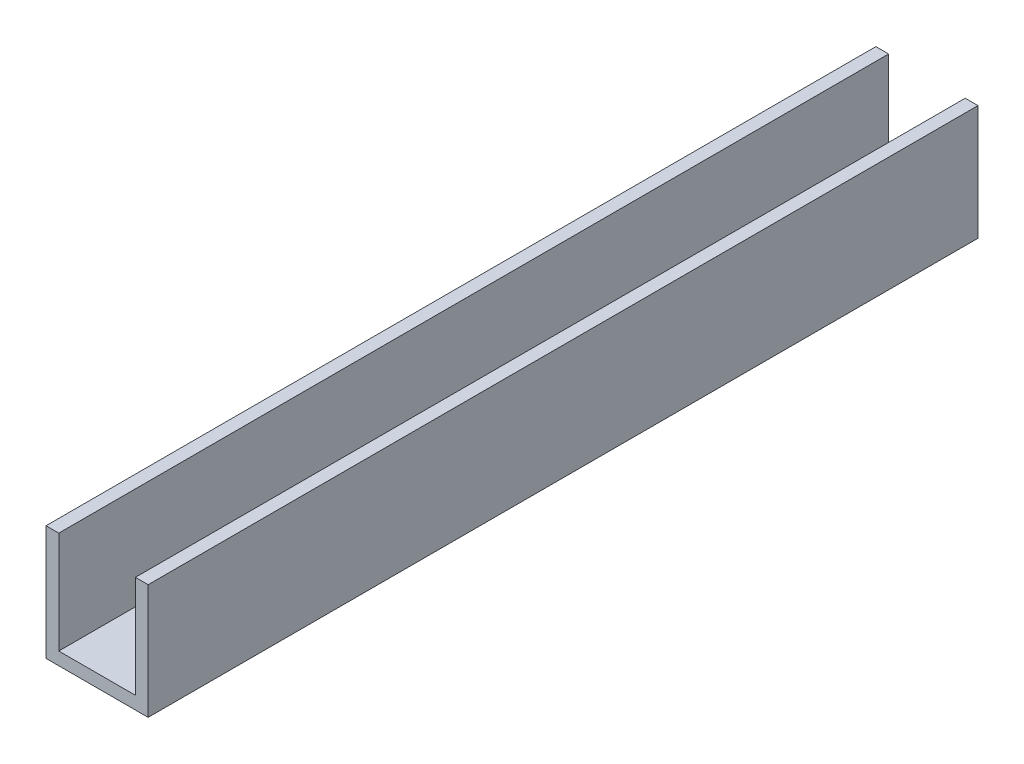
ISO-10303-21;
HEADER;
FILE_DESCRIPTION(('STEP AP214'),'2;1');
FILE_NAME('part.step','',(''),(''),'','','');
FILE_SCHEMA(('AUTOMOTIVE_DESIGN { 1 0 10303 214 1 1 1 1 }'));
ENDSEC;
DATA;
#1=APPLICATION_CONTEXT('core data for automotive mechanical design processes');
#2=APPLICATION_PROTOCOL_DEFINITION('international standard','automotive_design',2000,#1);
#3=PRODUCT_CONTEXT('',#1,'mechanical');
#4=PRODUCT('Part','Part','',(#3));
#5=PRODUCT_RELATED_PRODUCT_CATEGORY('part','',(#4));
#6=PRODUCT_DEFINITION_FORMATION('','',#4);
#7=PRODUCT_DEFINITION_CONTEXT('part definition',#1,'design');
#8=PRODUCT_DEFINITION('design','',#6,#7);
#9=PRODUCT_DEFINITION_SHAPE('','',#8);
#10=(LENGTH_UNIT() NAMED_UNIT(*) SI_UNIT(.MILLI.,.METRE.));
#11=(NAMED_UNIT(*) PLANE_ANGLE_UNIT() SI_UNIT($,.RADIAN.));
#12=(NAMED_UNIT(*) SI_UNIT($,.STERADIAN.) SOLID_ANGLE_UNIT());
#13=UNCERTAINTY_MEASURE_WITH_UNIT(LENGTH_MEASURE(1.E-05),#10,'distance_accuracy_value','');
#14=(GEOMETRIC_REPRESENTATION_CONTEXT(3) GLOBAL_UNCERTAINTY_ASSIGNED_CONTEXT((#13)) GLOBAL_UNIT_ASSIGNED_CONTEXT((#10,
#11,#12)) REPRESENTATION_CONTEXT('',''));
#15=CARTESIAN_POINT('',(0.,0.,0.));
#16=DIRECTION('',(0.,0.,1.));
#17=DIRECTION('',(1.,0.,0.));
#18=AXIS2_PLACEMENT_3D('',#15,#16,#17);
#19=CARTESIAN_POINT('',(0.,0.,6500.));
#20=DIRECTION('',(-1.,0.,0.));
#21=DIRECTION('',(0.,0.,1.));
#22=AXIS2_PLACEMENT_3D('',#19,#20,#21);
#23=PLANE('',#22);
#24=DIRECTION('',(0.,1.,0.));
#25=VECTOR('',#24,1.);
#26=CARTESIAN_POINT('',(0.,0.,0.));
#27=LINE('',#26,#25);
#28=CARTESIAN_POINT('',(0.,0.,0.));
#29=VERTEX_POINT('',#28);
#30=CARTESIAN_POINT('',(0.,900.,0.));
#31=VERTEX_POINT('',#30);
#32=EDGE_CURVE('E128',#29,#31,#27,.T.);
#33=ORIENTED_EDGE('',*,*,#32,.T.);
#34=DIRECTION('',(0.,0.,-1.));
#35=VECTOR('',#34,1.);
#36=CARTESIAN_POINT('',(0.,900.,6500.));
#37=LINE('',#36,#35);
#38=CARTESIAN_POINT('',(0.,900.,6500.));
#39=VERTEX_POINT('',#38);
#40=EDGE_CURVE('E11',#39,#31,#37,.T.);
#41=ORIENTED_EDGE('',*,*,#40,.F.);
#42=DIRECTION('',(0.,1.,0.));
#43=VECTOR('',#42,1.);
#44=CARTESIAN_POINT('',(0.,0.,6500.));
#45=LINE('',#44,#43);
#46=CARTESIAN_POINT('',(0.,0.,6500.));
#47=VERTEX_POINT('',#46);
#48=EDGE_CURVE('E142',#47,#39,#45,.T.);
#49=ORIENTED_EDGE('',*,*,#48,.F.);
#50=DIRECTION('',(0.,0.,-1.));
#51=VECTOR('',#50,1.);
#52=CARTESIAN_POINT('',(0.,0.,6500.));
#53=LINE('',#52,#51);
#54=EDGE_CURVE('E124',#47,#29,#53,.T.);
#55=ORIENTED_EDGE('',*,*,#54,.T.);
#56=EDGE_LOOP('',(#33,#41,#49,#55));
#57=FACE_BOUND('',#56,.T.);
#58=ADVANCED_FACE('F32',(#57),#23,.F.);
#59=CARTESIAN_POINT('',(-100.,900.,6500.));
#60=DIRECTION('',(0.,-1.,0.));
#61=DIRECTION('',(1.,0.,0.));
#62=AXIS2_PLACEMENT_3D('',#59,#60,#61);
#63=PLANE('',#62);
#64=DIRECTION('',(-1.,0.,0.));
#65=VECTOR('',#64,1.);
#66=CARTESIAN_POINT('',(-100.,900.,0.));
#67=LINE('',#66,#65);
#68=CARTESIAN_POINT('',(-100.,900.,0.));
#69=VERTEX_POINT('',#68);
#70=EDGE_CURVE('E131',#31,#69,#67,.T.);
#71=ORIENTED_EDGE('',*,*,#70,.T.);
#72=DIRECTION('',(0.,0.,-1.));
#73=VECTOR('',#72,1.);
#74=CARTESIAN_POINT('',(-100.,900.,6500.));
#75=LINE('',#74,#73);
#76=CARTESIAN_POINT('',(-100.,900.,6500.));
#77=VERTEX_POINT('',#76);
#78=EDGE_CURVE('E40',#77,#69,#75,.T.);
#79=ORIENTED_EDGE('',*,*,#78,.F.);
#80=DIRECTION('',(-1.,0.,0.));
#81=VECTOR('',#80,1.);
#82=CARTESIAN_POINT('',(-100.,900.,6500.));
#83=LINE('',#82,#81);
#84=EDGE_CURVE('E91',#39,#77,#83,.T.);
#85=ORIENTED_EDGE('',*,*,#84,.F.);
#86=ORIENTED_EDGE('',*,*,#40,.T.);
#87=EDGE_LOOP('',(#71,#79,#85,#86));
#88=FACE_BOUND('',#87,.T.);
#89=ADVANCED_FACE('F177',(#88),#63,.F.);
#90=CARTESIAN_POINT('',(-100.,99.9999999999999,6500.));
#91=DIRECTION('',(1.,0.,0.));
#92=DIRECTION('',(0.,1.,0.));
#93=AXIS2_PLACEMENT_3D('',#90,#91,#92);
#94=PLANE('',#93);
#95=DIRECTION('',(0.,-1.,0.));
#96=VECTOR('',#95,1.);
#97=CARTESIAN_POINT('',(-100.,99.9999999999999,0.));
#98=LINE('',#97,#96);
#99=CARTESIAN_POINT('',(-100.,99.9999999999999,0.));
#100=VERTEX_POINT('',#99);
#101=EDGE_CURVE('E133',#69,#100,#98,.T.);
#102=ORIENTED_EDGE('',*,*,#101,.T.);
#103=DIRECTION('',(0.,0.,-1.));
#104=VECTOR('',#103,1.);
#105=CARTESIAN_POINT('',(-100.,99.9999999999999,6500.));
#106=LINE('',#105,#104);
#107=CARTESIAN_POINT('',(-100.,99.9999999999999,6500.));
#108=VERTEX_POINT('',#107);
#109=EDGE_CURVE('E149',#108,#100,#106,.T.);
#110=ORIENTED_EDGE('',*,*,#109,.F.);
#111=DIRECTION('',(0.,-1.,0.));
#112=VECTOR('',#111,1.);
#113=CARTESIAN_POINT('',(-100.,99.9999999999999,6500.));
#114=LINE('',#113,#112);
#115=EDGE_CURVE('E157',#77,#108,#114,.T.);
#116=ORIENTED_EDGE('',*,*,#115,.F.);
#117=ORIENTED_EDGE('',*,*,#78,.T.);
#118=EDGE_LOOP('',(#102,#110,#116,#117));
#119=FACE_BOUND('',#118,.T.);
#120=ADVANCED_FACE('F155',(#119),#94,.F.);
#121=CARTESIAN_POINT('',(-700.,99.9999999999999,6500.));
#122=DIRECTION('',(0.,-1.,0.));
#123=DIRECTION('',(0.,0.,-1.));
#124=AXIS2_PLACEMENT_3D('',#121,#122,#123);
#125=PLANE('',#124);
#126=DIRECTION('',(-1.,0.,0.));
#127=VECTOR('',#126,1.);
#128=CARTESIAN_POINT('',(-700.,99.9999999999999,0.));
#129=LINE('',#128,#127);
#130=CARTESIAN_POINT('',(-700.,99.9999999999999,0.));
#131=VERTEX_POINT('',#130);
#132=EDGE_CURVE('E135',#100,#131,#129,.T.);
#133=ORIENTED_EDGE('',*,*,#132,.T.);
#134=DIRECTION('',(0.,0.,-1.));
#135=VECTOR('',#134,1.);
#136=CARTESIAN_POINT('',(-700.,99.9999999999999,6500.));
#137=LINE('',#136,#135);
#138=CARTESIAN_POINT('',(-700.,99.9999999999999,6500.));
#139=VERTEX_POINT('',#138);
#140=EDGE_CURVE('E146',#139,#131,#137,.T.);
#141=ORIENTED_EDGE('',*,*,#140,.F.);
#142=DIRECTION('',(-1.,0.,0.));
#143=VECTOR('',#142,1.);
#144=CARTESIAN_POINT('',(-700.,99.9999999999999,6500.));
#145=LINE('',#144,#143);
#146=EDGE_CURVE('E169',#108,#139,#145,.T.);
#147=ORIENTED_EDGE('',*,*,#146,.F.);
#148=ORIENTED_EDGE('',*,*,#109,.T.);
#149=EDGE_LOOP('',(#133,#141,#147,#148));
#150=FACE_BOUND('',#149,.T.);
#151=ADVANCED_FACE('F165',(#150),#125,.F.);
#152=CARTESIAN_POINT('',(-700.,99.9999999999999,6500.));
#153=DIRECTION('',(-1.,0.,0.));
#154=DIRECTION('',(0.,0.,1.));
#155=AXIS2_PLACEMENT_3D('',#152,#153,#154);
#156=PLANE('',#155);
#157=DIRECTION('',(0.,1.,0.));
#158=VECTOR('',#157,1.);
#159=CARTESIAN_POINT('',(-700.,99.9999999999999,0.));
#160=LINE('',#159,#158);
#161=CARTESIAN_POINT('',(-700.,900.,0.));
#162=VERTEX_POINT('',#161);
#163=EDGE_CURVE('E137',#131,#162,#160,.T.);
#164=ORIENTED_EDGE('',*,*,#163,.T.);
#165=DIRECTION('',(0.,0.,-1.));
#166=VECTOR('',#165,1.);
#167=CARTESIAN_POINT('',(-700.,900.,6500.));
#168=LINE('',#167,#166);
#169=CARTESIAN_POINT('',(-700.,900.,6500.));
#170=VERTEX_POINT('',#169);
#171=EDGE_CURVE('E119',#170,#162,#168,.T.);
#172=ORIENTED_EDGE('',*,*,#171,.F.);
#173=DIRECTION('',(0.,1.,0.));
#174=VECTOR('',#173,1.);
#175=CARTESIAN_POINT('',(-700.,99.9999999999999,6500.));
#176=LINE('',#175,#174);
#177=EDGE_CURVE('E110',#139,#170,#176,.T.);
#178=ORIENTED_EDGE('',*,*,#177,.F.);
#179=ORIENTED_EDGE('',*,*,#140,.T.);
#180=EDGE_LOOP('',(#164,#172,#178,#179));
#181=FACE_BOUND('',#180,.T.);
#182=ADVANCED_FACE('F168',(#181),#156,.F.);
#183=CARTESIAN_POINT('',(-700.,900.,6500.));
#184=DIRECTION('',(0.,-1.,0.));
#185=DIRECTION('',(0.,0.,-1.));
#186=AXIS2_PLACEMENT_3D('',#183,#184,#185);
#187=PLANE('',#186);
#188=DIRECTION('',(-1.,0.,0.));
#189=VECTOR('',#188,1.);
#190=CARTESIAN_POINT('',(-700.,900.,0.));
#191=LINE('',#190,#189);
#192=CARTESIAN_POINT('',(-800.,900.,0.));
#193=VERTEX_POINT('',#192);
#194=EDGE_CURVE('E118',#162,#193,#191,.T.);
#195=ORIENTED_EDGE('',*,*,#194,.T.);
#196=DIRECTION('',(0.,0.,-1.));
#197=VECTOR('',#196,1.);
#198=CARTESIAN_POINT('',(-800.,900.,6500.));
#199=LINE('',#198,#197);
#200=CARTESIAN_POINT('',(-800.,900.,6500.));
#201=VERTEX_POINT('',#200);
#202=EDGE_CURVE('E115',#201,#193,#199,.T.);
#203=ORIENTED_EDGE('',*,*,#202,.F.);
#204=DIRECTION('',(-1.,0.,0.));
#205=VECTOR('',#204,1.);
#206=CARTESIAN_POINT('',(-700.,900.,6500.));
#207=LINE('',#206,#205);
#208=EDGE_CURVE('E104',#170,#201,#207,.T.);
#209=ORIENTED_EDGE('',*,*,#208,.F.);
#210=ORIENTED_EDGE('',*,*,#171,.T.);
#211=EDGE_LOOP('',(#195,#203,#209,#210));
#212=FACE_BOUND('',#211,.T.);
#213=ADVANCED_FACE('F116',(#212),#187,.F.);
#214=CARTESIAN_POINT('',(-800.,0.,6500.));
#215=DIRECTION('',(1.,0.,0.));
#216=DIRECTION('',(0.,0.,-1.));
#217=AXIS2_PLACEMENT_3D('',#214,#215,#216);
#218=PLANE('',#217);
#219=DIRECTION('',(0.,-1.,0.));
#220=VECTOR('',#219,1.);
#221=CARTESIAN_POINT('',(-800.,0.,0.));
#222=LINE('',#221,#220);
#223=CARTESIAN_POINT('',(-800.,0.,0.));
#224=VERTEX_POINT('',#223);
#225=EDGE_CURVE('E77',#193,#224,#222,.T.);
#226=ORIENTED_EDGE('',*,*,#225,.T.);
#227=DIRECTION('',(0.,0.,-1.));
#228=VECTOR('',#227,1.);
#229=CARTESIAN_POINT('',(-800.,0.,6500.));
#230=LINE('',#229,#228);
#231=CARTESIAN_POINT('',(-800.,0.,6500.));
#232=VERTEX_POINT('',#231);
#233=EDGE_CURVE('E120',#232,#224,#230,.T.);
#234=ORIENTED_EDGE('',*,*,#233,.F.);
#235=DIRECTION('',(0.,-1.,0.));
#236=VECTOR('',#235,1.);
#237=CARTESIAN_POINT('',(-800.,0.,6500.));
#238=LINE('',#237,#236);
#239=EDGE_CURVE('E108',#201,#232,#238,.T.);
#240=ORIENTED_EDGE('',*,*,#239,.F.);
#241=ORIENTED_EDGE('',*,*,#202,.T.);
#242=EDGE_LOOP('',(#226,#234,#240,#241));
#243=FACE_BOUND('',#242,.T.);
#244=ADVANCED_FACE('F122',(#243),#218,.F.);
#245=CARTESIAN_POINT('',(0.,0.,6500.));
#246=DIRECTION('',(0.,1.,0.));
#247=DIRECTION('',(0.,0.,1.));
#248=AXIS2_PLACEMENT_3D('',#245,#246,#247);
#249=PLANE('',#248);
#250=DIRECTION('',(1.,0.,0.));
#251=VECTOR('',#250,1.);
#252=CARTESIAN_POINT('',(0.,0.,0.));
#253=LINE('',#252,#251);
#254=EDGE_CURVE('E83',#224,#29,#253,.T.);
#255=ORIENTED_EDGE('',*,*,#254,.T.);
#256=ORIENTED_EDGE('',*,*,#54,.F.);
#257=DIRECTION('',(1.,0.,0.));
#258=VECTOR('',#257,1.);
#259=CARTESIAN_POINT('',(0.,0.,6500.));
#260=LINE('',#259,#258);
#261=EDGE_CURVE('E48',#232,#47,#260,.T.);
#262=ORIENTED_EDGE('',*,*,#261,.F.);
#263=ORIENTED_EDGE('',*,*,#233,.T.);
#264=EDGE_LOOP('',(#255,#256,#262,#263));
#265=FACE_BOUND('',#264,.T.);
#266=ADVANCED_FACE('F193',(#265),#249,.F.);
#267=CARTESIAN_POINT('',(0.,0.,6500.));
#268=DIRECTION('',(0.,0.,-1.));
#269=DIRECTION('',(-1.,0.,0.));
#270=AXIS2_PLACEMENT_3D('',#267,#268,#269);
#271=PLANE('',#270);
#272=ORIENTED_EDGE('',*,*,#48,.T.);
#273=ORIENTED_EDGE('',*,*,#84,.T.);
#274=ORIENTED_EDGE('',*,*,#115,.T.);
#275=ORIENTED_EDGE('',*,*,#146,.T.);
#276=ORIENTED_EDGE('',*,*,#177,.T.);
#277=ORIENTED_EDGE('',*,*,#208,.T.);
#278=ORIENTED_EDGE('',*,*,#239,.T.);
#279=ORIENTED_EDGE('',*,*,#261,.T.);
#280=EDGE_LOOP('',(#272,#273,#274,#275,#276,#277,#278,#279));
#281=FACE_BOUND('',#280,.T.);
#282=ADVANCED_FACE('F106',(#281),#271,.F.);
#283=CARTESIAN_POINT('',(0.,0.,0.));
#284=DIRECTION('',(0.,0.,-1.));
#285=DIRECTION('',(-1.,0.,0.));
#286=AXIS2_PLACEMENT_3D('',#283,#284,#285);
#287=PLANE('',#286);
#288=ORIENTED_EDGE('',*,*,#32,.F.);
#289=ORIENTED_EDGE('',*,*,#254,.F.);
#290=ORIENTED_EDGE('',*,*,#225,.F.);
#291=ORIENTED_EDGE('',*,*,#194,.F.);
#292=ORIENTED_EDGE('',*,*,#163,.F.);
#293=ORIENTED_EDGE('',*,*,#132,.F.);
#294=ORIENTED_EDGE('',*,*,#101,.F.);
#295=ORIENTED_EDGE('',*,*,#70,.F.);
#296=EDGE_LOOP('',(#288,#289,#290,#291,#292,#293,#294,#295));
#297=FACE_BOUND('',#296,.T.);
#298=ADVANCED_FACE('F161',(#297),#287,.T.);
#299=CLOSED_SHELL('',(#58,#89,#120,#151,#182,#213,#244,#266,#282,#298));
#300=MANIFOLD_SOLID_BREP('B2',#299);
#301=ADVANCED_BREP_SHAPE_REPRESENTATION('',(#18,#300),#14);
#302=SHAPE_DEFINITION_REPRESENTATION(#9,#301);
ENDSEC;
END-ISO-10303-21;
